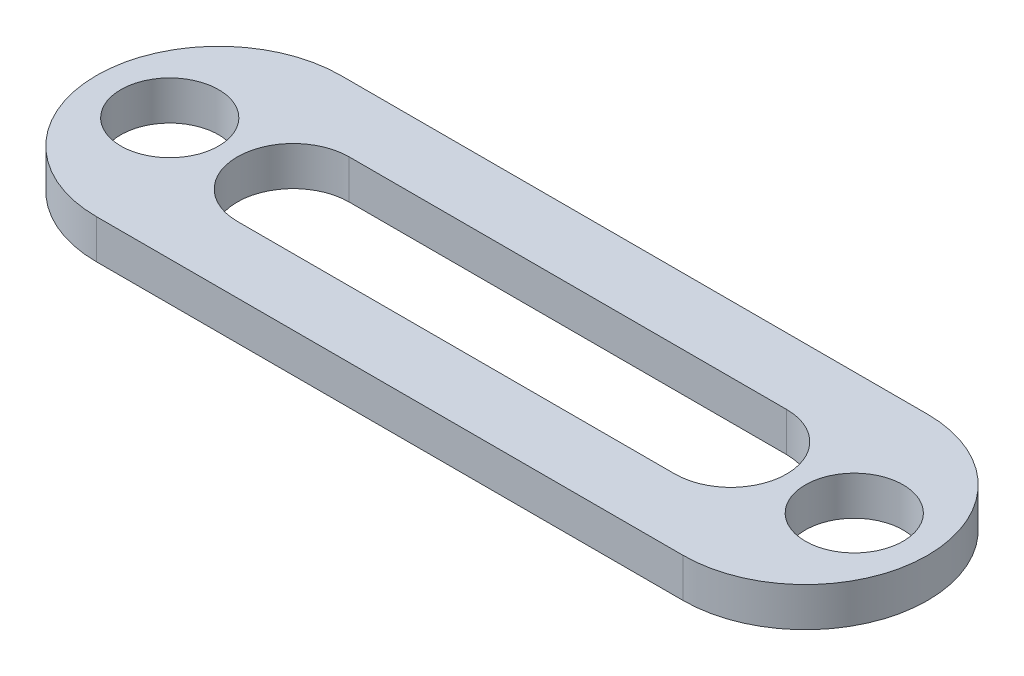
ISO-10303-21;
HEADER;
FILE_DESCRIPTION(('STEP AP214'),'2;1');
FILE_NAME('part.step','',(''),(''),'','','');
FILE_SCHEMA(('AUTOMOTIVE_DESIGN { 1 0 10303 214 1 1 1 1 }'));
ENDSEC;
DATA;
#1=APPLICATION_CONTEXT('core data for automotive mechanical design processes');
#2=APPLICATION_PROTOCOL_DEFINITION('international standard','automotive_design',2000,#1);
#3=PRODUCT_CONTEXT('',#1,'mechanical');
#4=PRODUCT('Part','Part','',(#3));
#5=PRODUCT_RELATED_PRODUCT_CATEGORY('part','',(#4));
#6=PRODUCT_DEFINITION_FORMATION('','',#4);
#7=PRODUCT_DEFINITION_CONTEXT('part definition',#1,'design');
#8=PRODUCT_DEFINITION('design','',#6,#7);
#9=PRODUCT_DEFINITION_SHAPE('','',#8);
#10=(LENGTH_UNIT() NAMED_UNIT(*) SI_UNIT(.MILLI.,.METRE.));
#11=(NAMED_UNIT(*) PLANE_ANGLE_UNIT() SI_UNIT($,.RADIAN.));
#12=(NAMED_UNIT(*) SI_UNIT($,.STERADIAN.) SOLID_ANGLE_UNIT());
#13=UNCERTAINTY_MEASURE_WITH_UNIT(LENGTH_MEASURE(1.E-05),#10,'distance_accuracy_value','');
#14=(GEOMETRIC_REPRESENTATION_CONTEXT(3) GLOBAL_UNCERTAINTY_ASSIGNED_CONTEXT((#13)) GLOBAL_UNIT_ASSIGNED_CONTEXT((#10,
#11,#12)) REPRESENTATION_CONTEXT('',''));
#15=CARTESIAN_POINT('',(0.,0.,0.));
#16=DIRECTION('',(0.,0.,1.));
#17=DIRECTION('',(1.,0.,0.));
#18=AXIS2_PLACEMENT_3D('',#15,#16,#17);
#19=CARTESIAN_POINT('',(0.,1.016,0.));
#20=DIRECTION('',(0.,1.,0.));
#21=DIRECTION('',(0.,0.,1.));
#22=AXIS2_PLACEMENT_3D('',#19,#20,#21);
#23=PLANE('',#22);
#24=CARTESIAN_POINT('',(-1.27,1.016,0.));
#25=DIRECTION('',(0.,1.,0.));
#26=DIRECTION('',(0.,0.,1.));
#27=AXIS2_PLACEMENT_3D('',#24,#25,#26);
#28=CIRCLE('',#27,1.27);
#29=CARTESIAN_POINT('',(-1.27,1.016,1.27));
#30=VERTEX_POINT('',#29);
#31=EDGE_CURVE('E141',#30,#30,#28,.T.);
#32=ORIENTED_EDGE('',*,*,#31,.F.);
#33=EDGE_LOOP('',(#32));
#34=FACE_BOUND('',#33,.T.);
#35=CARTESIAN_POINT('',(0.,1.016,0.));
#36=DIRECTION('',(0.,1.,0.));
#37=DIRECTION('',(0.,0.,1.));
#38=AXIS2_PLACEMENT_3D('',#35,#36,#37);
#39=CIRCLE('',#38,3.175);
#40=CARTESIAN_POINT('',(0.,1.016,-3.175));
#41=VERTEX_POINT('',#40);
#42=CARTESIAN_POINT('',(0.,1.016,3.175));
#43=VERTEX_POINT('',#42);
#44=EDGE_CURVE('E147',#41,#43,#39,.T.);
#45=ORIENTED_EDGE('',*,*,#44,.T.);
#46=DIRECTION('',(1.,0.,0.));
#47=VECTOR('',#46,1.);
#48=CARTESIAN_POINT('',(0.,1.016,3.175));
#49=LINE('',#48,#47);
#50=CARTESIAN_POINT('',(15.24,1.016,3.175));
#51=VERTEX_POINT('',#50);
#52=EDGE_CURVE('E150',#43,#51,#49,.T.);
#53=ORIENTED_EDGE('',*,*,#52,.T.);
#54=CARTESIAN_POINT('',(15.24,1.016,0.));
#55=DIRECTION('',(0.,1.,0.));
#56=DIRECTION('',(0.,0.,1.));
#57=AXIS2_PLACEMENT_3D('',#54,#55,#56);
#58=CIRCLE('',#57,3.175);
#59=CARTESIAN_POINT('',(15.24,1.016,-3.175));
#60=VERTEX_POINT('',#59);
#61=EDGE_CURVE('E153',#51,#60,#58,.T.);
#62=ORIENTED_EDGE('',*,*,#61,.T.);
#63=DIRECTION('',(-1.,0.,0.));
#64=VECTOR('',#63,1.);
#65=CARTESIAN_POINT('',(0.,1.016,-3.175));
#66=LINE('',#65,#64);
#67=EDGE_CURVE('E155',#60,#41,#66,.T.);
#68=ORIENTED_EDGE('',*,*,#67,.T.);
#69=EDGE_LOOP('',(#45,#53,#62,#68));
#70=FACE_BOUND('',#69,.T.);
#71=CARTESIAN_POINT('',(16.51,1.016,0.));
#72=DIRECTION('',(0.,1.,0.));
#73=DIRECTION('',(0.,0.,1.));
#74=AXIS2_PLACEMENT_3D('',#71,#72,#73);
#75=CIRCLE('',#74,1.27);
#76=CARTESIAN_POINT('',(16.51,1.016,1.27));
#77=VERTEX_POINT('',#76);
#78=EDGE_CURVE('E135',#77,#77,#75,.T.);
#79=ORIENTED_EDGE('',*,*,#78,.F.);
#80=EDGE_LOOP('',(#79));
#81=FACE_BOUND('',#80,.T.);
#82=DIRECTION('',(1.,0.,0.));
#83=VECTOR('',#82,1.);
#84=CARTESIAN_POINT('',(1.93721773500583,1.016,1.45174902124851));
#85=LINE('',#84,#83);
#86=CARTESIAN_POINT('',(1.93721773500583,1.016,1.45174902124851));
#87=VERTEX_POINT('',#86);
#88=CARTESIAN_POINT('',(13.3027822649942,1.016,1.45174902124851));
#89=VERTEX_POINT('',#88);
#90=EDGE_CURVE('E107',#87,#89,#85,.T.);
#91=ORIENTED_EDGE('',*,*,#90,.F.);
#92=CARTESIAN_POINT('',(1.93721773500583,1.016,0.));
#93=DIRECTION('',(0.,1.,0.));
#94=DIRECTION('',(0.,0.,1.));
#95=AXIS2_PLACEMENT_3D('',#92,#93,#94);
#96=CIRCLE('',#95,1.45174902124851);
#97=CARTESIAN_POINT('',(1.93721773500583,1.016,-1.45174902124851));
#98=VERTEX_POINT('',#97);
#99=EDGE_CURVE('E99',#98,#87,#96,.T.);
#100=ORIENTED_EDGE('',*,*,#99,.F.);
#101=DIRECTION('',(-1.,0.,0.));
#102=VECTOR('',#101,1.);
#103=CARTESIAN_POINT('',(1.93721773500583,1.016,-1.45174902124851));
#104=LINE('',#103,#102);
#105=CARTESIAN_POINT('',(13.3027822649942,1.016,-1.45174902124851));
#106=VERTEX_POINT('',#105);
#107=EDGE_CURVE('E121',#106,#98,#104,.T.);
#108=ORIENTED_EDGE('',*,*,#107,.F.);
#109=CARTESIAN_POINT('',(13.3027822649942,1.016,0.));
#110=DIRECTION('',(0.,1.,0.));
#111=DIRECTION('',(0.,0.,1.));
#112=AXIS2_PLACEMENT_3D('',#109,#110,#111);
#113=CIRCLE('',#112,1.45174902124851);
#114=EDGE_CURVE('E119',#89,#106,#113,.T.);
#115=ORIENTED_EDGE('',*,*,#114,.F.);
#116=EDGE_LOOP('',(#91,#100,#108,#115));
#117=FACE_BOUND('',#116,.T.);
#118=ADVANCED_FACE('F34',(#34,#70,#81,#117),#23,.T.);
#119=CARTESIAN_POINT('',(0.,0.,0.));
#120=DIRECTION('',(0.,1.,0.));
#121=DIRECTION('',(0.,0.,1.));
#122=AXIS2_PLACEMENT_3D('',#119,#120,#121);
#123=PLANE('',#122);
#124=CARTESIAN_POINT('',(16.51,0.,0.));
#125=DIRECTION('',(0.,1.,0.));
#126=DIRECTION('',(0.,0.,1.));
#127=AXIS2_PLACEMENT_3D('',#124,#125,#126);
#128=CIRCLE('',#127,1.27);
#129=CARTESIAN_POINT('',(16.51,0.,1.27));
#130=VERTEX_POINT('',#129);
#131=EDGE_CURVE('E115',#130,#130,#128,.T.);
#132=ORIENTED_EDGE('',*,*,#131,.T.);
#133=EDGE_LOOP('',(#132));
#134=FACE_BOUND('',#133,.T.);
#135=CARTESIAN_POINT('',(-1.27,0.,0.));
#136=DIRECTION('',(0.,1.,0.));
#137=DIRECTION('',(0.,0.,1.));
#138=AXIS2_PLACEMENT_3D('',#135,#136,#137);
#139=CIRCLE('',#138,1.27);
#140=CARTESIAN_POINT('',(-1.27,0.,1.27));
#141=VERTEX_POINT('',#140);
#142=EDGE_CURVE('E138',#141,#141,#139,.T.);
#143=ORIENTED_EDGE('',*,*,#142,.T.);
#144=EDGE_LOOP('',(#143));
#145=FACE_BOUND('',#144,.T.);
#146=CARTESIAN_POINT('',(0.,0.,0.));
#147=DIRECTION('',(0.,1.,0.));
#148=DIRECTION('',(0.,0.,1.));
#149=AXIS2_PLACEMENT_3D('',#146,#147,#148);
#150=CIRCLE('',#149,3.175);
#151=CARTESIAN_POINT('',(0.,0.,-3.175));
#152=VERTEX_POINT('',#151);
#153=CARTESIAN_POINT('',(0.,0.,3.175));
#154=VERTEX_POINT('',#153);
#155=EDGE_CURVE('E144',#152,#154,#150,.T.);
#156=ORIENTED_EDGE('',*,*,#155,.F.);
#157=DIRECTION('',(-1.,0.,0.));
#158=VECTOR('',#157,1.);
#159=CARTESIAN_POINT('',(0.,0.,-3.175));
#160=LINE('',#159,#158);
#161=CARTESIAN_POINT('',(15.24,0.,-3.175));
#162=VERTEX_POINT('',#161);
#163=EDGE_CURVE('E151',#162,#152,#160,.T.);
#164=ORIENTED_EDGE('',*,*,#163,.F.);
#165=CARTESIAN_POINT('',(15.24,0.,0.));
#166=DIRECTION('',(0.,1.,0.));
#167=DIRECTION('',(0.,0.,1.));
#168=AXIS2_PLACEMENT_3D('',#165,#166,#167);
#169=CIRCLE('',#168,3.175);
#170=CARTESIAN_POINT('',(15.24,0.,3.175));
#171=VERTEX_POINT('',#170);
#172=EDGE_CURVE('E162',#171,#162,#169,.T.);
#173=ORIENTED_EDGE('',*,*,#172,.F.);
#174=DIRECTION('',(1.,0.,0.));
#175=VECTOR('',#174,1.);
#176=CARTESIAN_POINT('',(0.,0.,3.175));
#177=LINE('',#176,#175);
#178=EDGE_CURVE('E160',#154,#171,#177,.T.);
#179=ORIENTED_EDGE('',*,*,#178,.F.);
#180=EDGE_LOOP('',(#156,#164,#173,#179));
#181=FACE_BOUND('',#180,.T.);
#182=CARTESIAN_POINT('',(1.93721773500583,0.,0.));
#183=DIRECTION('',(0.,1.,0.));
#184=DIRECTION('',(0.,0.,1.));
#185=AXIS2_PLACEMENT_3D('',#182,#183,#184);
#186=CIRCLE('',#185,1.45174902124851);
#187=CARTESIAN_POINT('',(1.93721773500583,0.,-1.45174902124851));
#188=VERTEX_POINT('',#187);
#189=CARTESIAN_POINT('',(1.93721773500583,0.,1.45174902124851));
#190=VERTEX_POINT('',#189);
#191=EDGE_CURVE('E57',#188,#190,#186,.T.);
#192=ORIENTED_EDGE('',*,*,#191,.T.);
#193=DIRECTION('',(1.,0.,0.));
#194=VECTOR('',#193,1.);
#195=CARTESIAN_POINT('',(1.93721773500583,0.,1.45174902124851));
#196=LINE('',#195,#194);
#197=CARTESIAN_POINT('',(13.3027822649942,0.,1.45174902124851));
#198=VERTEX_POINT('',#197);
#199=EDGE_CURVE('E114',#190,#198,#196,.T.);
#200=ORIENTED_EDGE('',*,*,#199,.T.);
#201=CARTESIAN_POINT('',(13.3027822649942,0.,0.));
#202=DIRECTION('',(0.,1.,0.));
#203=DIRECTION('',(0.,0.,1.));
#204=AXIS2_PLACEMENT_3D('',#201,#202,#203);
#205=CIRCLE('',#204,1.45174902124851);
#206=CARTESIAN_POINT('',(13.3027822649942,0.,-1.45174902124851));
#207=VERTEX_POINT('',#206);
#208=EDGE_CURVE('E127',#198,#207,#205,.T.);
#209=ORIENTED_EDGE('',*,*,#208,.T.);
#210=DIRECTION('',(-1.,0.,0.));
#211=VECTOR('',#210,1.);
#212=CARTESIAN_POINT('',(1.93721773500583,0.,-1.45174902124851));
#213=LINE('',#212,#211);
#214=EDGE_CURVE('E108',#207,#188,#213,.T.);
#215=ORIENTED_EDGE('',*,*,#214,.T.);
#216=EDGE_LOOP('',(#192,#200,#209,#215));
#217=FACE_BOUND('',#216,.T.);
#218=ADVANCED_FACE('F180',(#134,#145,#181,#217),#123,.F.);
#219=CARTESIAN_POINT('',(0.,1.016,0.));
#220=DIRECTION('',(0.,-1.,0.));
#221=DIRECTION('',(0.,0.,-1.));
#222=AXIS2_PLACEMENT_3D('',#219,#220,#221);
#223=CYLINDRICAL_SURFACE('',#222,3.175);
#224=ORIENTED_EDGE('',*,*,#155,.T.);
#225=DIRECTION('',(0.,-1.,0.));
#226=VECTOR('',#225,1.);
#227=CARTESIAN_POINT('',(0.,1.016,3.175));
#228=LINE('',#227,#226);
#229=EDGE_CURVE('E11',#43,#154,#228,.T.);
#230=ORIENTED_EDGE('',*,*,#229,.F.);
#231=ORIENTED_EDGE('',*,*,#44,.F.);
#232=DIRECTION('',(0.,-1.,0.));
#233=VECTOR('',#232,1.);
#234=CARTESIAN_POINT('',(0.,1.016,-3.175));
#235=LINE('',#234,#233);
#236=EDGE_CURVE('E157',#41,#152,#235,.T.);
#237=ORIENTED_EDGE('',*,*,#236,.T.);
#238=EDGE_LOOP('',(#224,#230,#231,#237));
#239=FACE_BOUND('',#238,.T.);
#240=ADVANCED_FACE('F36',(#239),#223,.T.);
#241=CARTESIAN_POINT('',(0.,1.016,3.175));
#242=DIRECTION('',(0.,0.,-1.));
#243=DIRECTION('',(-1.,0.,0.));
#244=AXIS2_PLACEMENT_3D('',#241,#242,#243);
#245=PLANE('',#244);
#246=ORIENTED_EDGE('',*,*,#178,.T.);
#247=DIRECTION('',(0.,-1.,0.));
#248=VECTOR('',#247,1.);
#249=CARTESIAN_POINT('',(15.24,1.016,3.175));
#250=LINE('',#249,#248);
#251=EDGE_CURVE('E42',#51,#171,#250,.T.);
#252=ORIENTED_EDGE('',*,*,#251,.F.);
#253=ORIENTED_EDGE('',*,*,#52,.F.);
#254=ORIENTED_EDGE('',*,*,#229,.T.);
#255=EDGE_LOOP('',(#246,#252,#253,#254));
#256=FACE_BOUND('',#255,.T.);
#257=ADVANCED_FACE('F191',(#256),#245,.F.);
#258=CARTESIAN_POINT('',(15.24,1.016,0.));
#259=DIRECTION('',(0.,-1.,0.));
#260=DIRECTION('',(0.,0.,-1.));
#261=AXIS2_PLACEMENT_3D('',#258,#259,#260);
#262=CYLINDRICAL_SURFACE('',#261,3.175);
#263=ORIENTED_EDGE('',*,*,#172,.T.);
#264=DIRECTION('',(0.,-1.,0.));
#265=VECTOR('',#264,1.);
#266=CARTESIAN_POINT('',(15.24,1.016,-3.175));
#267=LINE('',#266,#265);
#268=EDGE_CURVE('E167',#60,#162,#267,.T.);
#269=ORIENTED_EDGE('',*,*,#268,.F.);
#270=ORIENTED_EDGE('',*,*,#61,.F.);
#271=ORIENTED_EDGE('',*,*,#251,.T.);
#272=EDGE_LOOP('',(#263,#269,#270,#271));
#273=FACE_BOUND('',#272,.T.);
#274=ADVANCED_FACE('F174',(#273),#262,.T.);
#275=CARTESIAN_POINT('',(0.,1.016,-3.175));
#276=DIRECTION('',(0.,0.,1.));
#277=DIRECTION('',(1.,0.,0.));
#278=AXIS2_PLACEMENT_3D('',#275,#276,#277);
#279=PLANE('',#278);
#280=ORIENTED_EDGE('',*,*,#163,.T.);
#281=ORIENTED_EDGE('',*,*,#236,.F.);
#282=ORIENTED_EDGE('',*,*,#67,.F.);
#283=ORIENTED_EDGE('',*,*,#268,.T.);
#284=EDGE_LOOP('',(#280,#281,#282,#283));
#285=FACE_BOUND('',#284,.T.);
#286=ADVANCED_FACE('F184',(#285),#279,.F.);
#287=CARTESIAN_POINT('',(-1.27,1.016,0.));
#288=DIRECTION('',(0.,-1.,0.));
#289=DIRECTION('',(0.,0.,-1.));
#290=AXIS2_PLACEMENT_3D('',#287,#288,#289);
#291=CYLINDRICAL_SURFACE('',#290,1.27);
#292=ORIENTED_EDGE('',*,*,#31,.T.);
#293=EDGE_LOOP('',(#292));
#294=FACE_BOUND('',#293,.T.);
#295=ORIENTED_EDGE('',*,*,#142,.F.);
#296=EDGE_LOOP('',(#295));
#297=FACE_BOUND('',#296,.T.);
#298=ADVANCED_FACE('F208',(#294,#297),#291,.F.);
#299=CARTESIAN_POINT('',(16.51,1.016,0.));
#300=DIRECTION('',(0.,-1.,0.));
#301=DIRECTION('',(0.,0.,-1.));
#302=AXIS2_PLACEMENT_3D('',#299,#300,#301);
#303=CYLINDRICAL_SURFACE('',#302,1.27);
#304=ORIENTED_EDGE('',*,*,#78,.T.);
#305=EDGE_LOOP('',(#304));
#306=FACE_BOUND('',#305,.T.);
#307=ORIENTED_EDGE('',*,*,#131,.F.);
#308=EDGE_LOOP('',(#307));
#309=FACE_BOUND('',#308,.T.);
#310=ADVANCED_FACE('F215',(#306,#309),#303,.F.);
#311=CARTESIAN_POINT('',(1.93721773500583,1.016,0.));
#312=DIRECTION('',(0.,-1.,0.));
#313=DIRECTION('',(0.,0.,-1.));
#314=AXIS2_PLACEMENT_3D('',#311,#312,#313);
#315=CYLINDRICAL_SURFACE('',#314,1.45174902124851);
#316=ORIENTED_EDGE('',*,*,#191,.F.);
#317=DIRECTION('',(0.,-1.,0.));
#318=VECTOR('',#317,1.);
#319=CARTESIAN_POINT('',(1.93721773500583,1.016,-1.45174902124851));
#320=LINE('',#319,#318);
#321=EDGE_CURVE('E103',#98,#188,#320,.T.);
#322=ORIENTED_EDGE('',*,*,#321,.F.);
#323=ORIENTED_EDGE('',*,*,#99,.T.);
#324=DIRECTION('',(0.,-1.,0.));
#325=VECTOR('',#324,1.);
#326=CARTESIAN_POINT('',(1.93721773500583,1.016,1.45174902124851));
#327=LINE('',#326,#325);
#328=EDGE_CURVE('E102',#87,#190,#327,.T.);
#329=ORIENTED_EDGE('',*,*,#328,.T.);
#330=EDGE_LOOP('',(#316,#322,#323,#329));
#331=FACE_BOUND('',#330,.T.);
#332=ADVANCED_FACE('F101',(#331),#315,.F.);
#333=CARTESIAN_POINT('',(1.93721773500583,1.016,1.45174902124851));
#334=DIRECTION('',(0.,0.,-1.));
#335=DIRECTION('',(-1.,0.,0.));
#336=AXIS2_PLACEMENT_3D('',#333,#334,#335);
#337=PLANE('',#336);
#338=ORIENTED_EDGE('',*,*,#199,.F.);
#339=ORIENTED_EDGE('',*,*,#328,.F.);
#340=ORIENTED_EDGE('',*,*,#90,.T.);
#341=DIRECTION('',(0.,-1.,0.));
#342=VECTOR('',#341,1.);
#343=CARTESIAN_POINT('',(13.3027822649942,1.016,1.45174902124851));
#344=LINE('',#343,#342);
#345=EDGE_CURVE('E116',#89,#198,#344,.T.);
#346=ORIENTED_EDGE('',*,*,#345,.T.);
#347=EDGE_LOOP('',(#338,#339,#340,#346));
#348=FACE_BOUND('',#347,.T.);
#349=ADVANCED_FACE('F111',(#348),#337,.T.);
#350=CARTESIAN_POINT('',(13.3027822649942,1.016,0.));
#351=DIRECTION('',(0.,-1.,0.));
#352=DIRECTION('',(0.,0.,-1.));
#353=AXIS2_PLACEMENT_3D('',#350,#351,#352);
#354=CYLINDRICAL_SURFACE('',#353,1.45174902124851);
#355=ORIENTED_EDGE('',*,*,#208,.F.);
#356=ORIENTED_EDGE('',*,*,#345,.F.);
#357=ORIENTED_EDGE('',*,*,#114,.T.);
#358=DIRECTION('',(0.,-1.,0.));
#359=VECTOR('',#358,1.);
#360=CARTESIAN_POINT('',(13.3027822649942,1.016,-1.45174902124851));
#361=LINE('',#360,#359);
#362=EDGE_CURVE('E49',#106,#207,#361,.T.);
#363=ORIENTED_EDGE('',*,*,#362,.T.);
#364=EDGE_LOOP('',(#355,#356,#357,#363));
#365=FACE_BOUND('',#364,.T.);
#366=ADVANCED_FACE('F232',(#365),#354,.F.);
#367=CARTESIAN_POINT('',(1.93721773500583,1.016,-1.45174902124851));
#368=DIRECTION('',(0.,0.,1.));
#369=DIRECTION('',(1.,0.,0.));
#370=AXIS2_PLACEMENT_3D('',#367,#368,#369);
#371=PLANE('',#370);
#372=ORIENTED_EDGE('',*,*,#214,.F.);
#373=ORIENTED_EDGE('',*,*,#362,.F.);
#374=ORIENTED_EDGE('',*,*,#107,.T.);
#375=ORIENTED_EDGE('',*,*,#321,.T.);
#376=EDGE_LOOP('',(#372,#373,#374,#375));
#377=FACE_BOUND('',#376,.T.);
#378=ADVANCED_FACE('F235',(#377),#371,.T.);
#379=CLOSED_SHELL('',(#118,#218,#240,#257,#274,#286,#298,#310,#332,#349,#366,#378));
#380=MANIFOLD_SOLID_BREP('B2',#379);
#381=ADVANCED_BREP_SHAPE_REPRESENTATION('',(#18,#380),#14);
#382=SHAPE_DEFINITION_REPRESENTATION(#9,#381);
ENDSEC;
END-ISO-10303-21;
